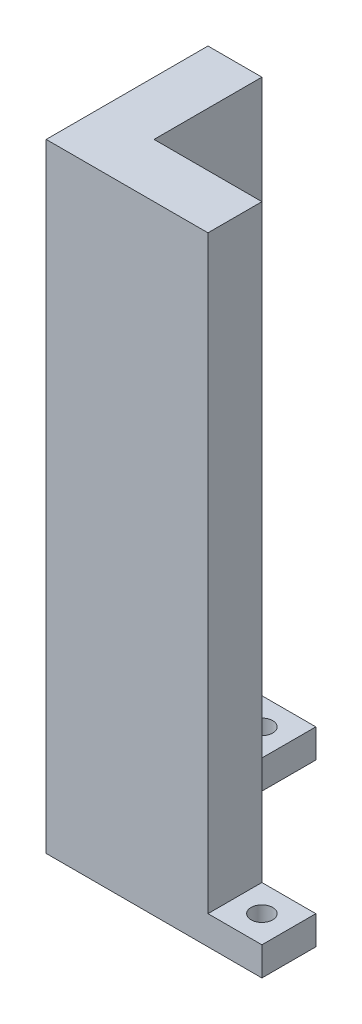
ISO-10303-21;
HEADER;
FILE_DESCRIPTION(('STEP AP214'),'2;1');
FILE_NAME('part.step','',(''),(''),'','','');
FILE_SCHEMA(('AUTOMOTIVE_DESIGN { 1 0 10303 214 1 1 1 1 }'));
ENDSEC;
DATA;
#1=APPLICATION_CONTEXT('core data for automotive mechanical design processes');
#2=APPLICATION_PROTOCOL_DEFINITION('international standard','automotive_design',2000,#1);
#3=PRODUCT_CONTEXT('',#1,'mechanical');
#4=PRODUCT('Part','Part','',(#3));
#5=PRODUCT_RELATED_PRODUCT_CATEGORY('part','',(#4));
#6=PRODUCT_DEFINITION_FORMATION('','',#4);
#7=PRODUCT_DEFINITION_CONTEXT('part definition',#1,'design');
#8=PRODUCT_DEFINITION('design','',#6,#7);
#9=PRODUCT_DEFINITION_SHAPE('','',#8);
#10=(LENGTH_UNIT() NAMED_UNIT(*) SI_UNIT(.MILLI.,.METRE.));
#11=(NAMED_UNIT(*) PLANE_ANGLE_UNIT() SI_UNIT($,.RADIAN.));
#12=(NAMED_UNIT(*) SI_UNIT($,.STERADIAN.) SOLID_ANGLE_UNIT());
#13=UNCERTAINTY_MEASURE_WITH_UNIT(LENGTH_MEASURE(1.E-05),#10,'distance_accuracy_value','');
#14=(GEOMETRIC_REPRESENTATION_CONTEXT(3) GLOBAL_UNCERTAINTY_ASSIGNED_CONTEXT((#13)) GLOBAL_UNIT_ASSIGNED_CONTEXT((#10,
#11,#12)) REPRESENTATION_CONTEXT('',''));
#15=CARTESIAN_POINT('',(0.,0.,0.));
#16=DIRECTION('',(0.,0.,1.));
#17=DIRECTION('',(1.,0.,0.));
#18=AXIS2_PLACEMENT_3D('',#15,#16,#17);
#19=CARTESIAN_POINT('',(0.,4.,0.));
#20=DIRECTION('',(0.,1.,0.));
#21=DIRECTION('',(0.,0.,1.));
#22=AXIS2_PLACEMENT_3D('',#19,#20,#21);
#23=PLANE('',#22);
#24=DIRECTION('',(0.,0.,-1.));
#25=VECTOR('',#24,1.);
#26=CARTESIAN_POINT('',(15.,4.,0.));
#27=LINE('',#26,#25);
#28=CARTESIAN_POINT('',(15.,4.,7.5));
#29=VERTEX_POINT('',#28);
#30=CARTESIAN_POINT('',(15.,4.,0.));
#31=VERTEX_POINT('',#30);
#32=EDGE_CURVE('E54',#29,#31,#27,.T.);
#33=ORIENTED_EDGE('',*,*,#32,.F.);
#34=DIRECTION('',(1.,0.,0.));
#35=VECTOR('',#34,1.);
#36=CARTESIAN_POINT('',(15.,4.,7.5));
#37=LINE('',#36,#35);
#38=CARTESIAN_POINT('',(22.5,4.,7.5));
#39=VERTEX_POINT('',#38);
#40=EDGE_CURVE('E178',#29,#39,#37,.T.);
#41=ORIENTED_EDGE('',*,*,#40,.T.);
#42=DIRECTION('',(0.,0.,-1.));
#43=VECTOR('',#42,1.);
#44=CARTESIAN_POINT('',(22.5,4.,0.));
#45=LINE('',#44,#43);
#46=CARTESIAN_POINT('',(22.5,4.,0.));
#47=VERTEX_POINT('',#46);
#48=EDGE_CURVE('E182',#39,#47,#45,.T.);
#49=ORIENTED_EDGE('',*,*,#48,.T.);
#50=DIRECTION('',(-1.,0.,0.));
#51=VECTOR('',#50,1.);
#52=CARTESIAN_POINT('',(22.5,4.,0.));
#53=LINE('',#52,#51);
#54=EDGE_CURVE('E50',#47,#31,#53,.T.);
#55=ORIENTED_EDGE('',*,*,#54,.T.);
#56=EDGE_LOOP('',(#33,#41,#49,#55));
#57=FACE_BOUND('',#56,.T.);
#58=CARTESIAN_POINT('',(18.75,4.,3.75));
#59=DIRECTION('',(0.,1.,0.));
#60=DIRECTION('',(0.,0.,1.));
#61=AXIS2_PLACEMENT_3D('',#58,#59,#60);
#62=CIRCLE('',#61,1.5);
#63=CARTESIAN_POINT('',(18.75,4.,5.25));
#64=VERTEX_POINT('',#63);
#65=EDGE_CURVE('E249',#64,#64,#62,.T.);
#66=ORIENTED_EDGE('',*,*,#65,.F.);
#67=EDGE_LOOP('',(#66));
#68=FACE_BOUND('',#67,.T.);
#69=ADVANCED_FACE('F33',(#57,#68),#23,.T.);
#70=DIRECTION('',(-1.,0.,0.));
#71=VECTOR('',#70,1.);
#72=CARTESIAN_POINT('',(0.,4.,-15.));
#73=LINE('',#72,#71);
#74=CARTESIAN_POINT('',(0.,4.,-15.));
#75=VERTEX_POINT('',#74);
#76=CARTESIAN_POINT('',(-7.5,4.,-15.));
#77=VERTEX_POINT('',#76);
#78=EDGE_CURVE('E136',#75,#77,#73,.T.);
#79=ORIENTED_EDGE('',*,*,#78,.F.);
#80=DIRECTION('',(0.,0.,-1.));
#81=VECTOR('',#80,1.);
#82=CARTESIAN_POINT('',(0.,4.,-15.));
#83=LINE('',#82,#81);
#84=CARTESIAN_POINT('',(0.,4.,-22.5));
#85=VERTEX_POINT('',#84);
#86=EDGE_CURVE('E208',#75,#85,#83,.T.);
#87=ORIENTED_EDGE('',*,*,#86,.T.);
#88=DIRECTION('',(-1.,0.,0.));
#89=VECTOR('',#88,1.);
#90=CARTESIAN_POINT('',(0.,4.,-22.5));
#91=LINE('',#90,#89);
#92=CARTESIAN_POINT('',(-7.5,4.,-22.5));
#93=VERTEX_POINT('',#92);
#94=EDGE_CURVE('E185',#85,#93,#91,.T.);
#95=ORIENTED_EDGE('',*,*,#94,.T.);
#96=DIRECTION('',(0.,0.,1.));
#97=VECTOR('',#96,1.);
#98=CARTESIAN_POINT('',(-7.5,4.,-22.5));
#99=LINE('',#98,#97);
#100=EDGE_CURVE('E183',#93,#77,#99,.T.);
#101=ORIENTED_EDGE('',*,*,#100,.T.);
#102=EDGE_LOOP('',(#79,#87,#95,#101));
#103=FACE_BOUND('',#102,.T.);
#104=CARTESIAN_POINT('',(-3.75,4.,-18.75));
#105=DIRECTION('',(0.,1.,0.));
#106=DIRECTION('',(0.,0.,1.));
#107=AXIS2_PLACEMENT_3D('',#104,#105,#106);
#108=CIRCLE('',#107,1.5);
#109=CARTESIAN_POINT('',(-3.75,4.,-17.25));
#110=VERTEX_POINT('',#109);
#111=EDGE_CURVE('E198',#110,#110,#108,.T.);
#112=ORIENTED_EDGE('',*,*,#111,.F.);
#113=EDGE_LOOP('',(#112));
#114=FACE_BOUND('',#113,.T.);
#115=ADVANCED_FACE('F223',(#103,#114),#23,.T.);
#116=CARTESIAN_POINT('',(0.,0.,0.));
#117=DIRECTION('',(0.,1.,0.));
#118=DIRECTION('',(0.,0.,1.));
#119=AXIS2_PLACEMENT_3D('',#116,#117,#118);
#120=PLANE('',#119);
#121=DIRECTION('',(0.,0.,-1.));
#122=VECTOR('',#121,1.);
#123=CARTESIAN_POINT('',(0.,0.,-15.));
#124=LINE('',#123,#122);
#125=CARTESIAN_POINT('',(0.,0.,0.));
#126=VERTEX_POINT('',#125);
#127=CARTESIAN_POINT('',(0.,0.,-22.5));
#128=VERTEX_POINT('',#127);
#129=EDGE_CURVE('E195',#126,#128,#124,.T.);
#130=ORIENTED_EDGE('',*,*,#129,.F.);
#131=DIRECTION('',(-1.,0.,0.));
#132=VECTOR('',#131,1.);
#133=CARTESIAN_POINT('',(0.,0.,0.));
#134=LINE('',#133,#132);
#135=CARTESIAN_POINT('',(22.5,0.,0.));
#136=VERTEX_POINT('',#135);
#137=EDGE_CURVE('E118',#136,#126,#134,.T.);
#138=ORIENTED_EDGE('',*,*,#137,.F.);
#139=DIRECTION('',(0.,0.,-1.));
#140=VECTOR('',#139,1.);
#141=CARTESIAN_POINT('',(22.5,0.,0.));
#142=LINE('',#141,#140);
#143=CARTESIAN_POINT('',(22.5,0.,7.5));
#144=VERTEX_POINT('',#143);
#145=EDGE_CURVE('E205',#144,#136,#142,.T.);
#146=ORIENTED_EDGE('',*,*,#145,.F.);
#147=DIRECTION('',(1.,0.,0.));
#148=VECTOR('',#147,1.);
#149=CARTESIAN_POINT('',(15.,0.,7.5));
#150=LINE('',#149,#148);
#151=CARTESIAN_POINT('',(-7.5,0.,7.5));
#152=VERTEX_POINT('',#151);
#153=EDGE_CURVE('E203',#152,#144,#150,.T.);
#154=ORIENTED_EDGE('',*,*,#153,.F.);
#155=DIRECTION('',(0.,0.,1.));
#156=VECTOR('',#155,1.);
#157=CARTESIAN_POINT('',(-7.5,0.,-22.5));
#158=LINE('',#157,#156);
#159=CARTESIAN_POINT('',(-7.5,0.,-22.5));
#160=VERTEX_POINT('',#159);
#161=EDGE_CURVE('E200',#160,#152,#158,.T.);
#162=ORIENTED_EDGE('',*,*,#161,.F.);
#163=DIRECTION('',(-1.,0.,0.));
#164=VECTOR('',#163,1.);
#165=CARTESIAN_POINT('',(0.,0.,-22.5));
#166=LINE('',#165,#164);
#167=EDGE_CURVE('E197',#128,#160,#166,.T.);
#168=ORIENTED_EDGE('',*,*,#167,.F.);
#169=EDGE_LOOP('',(#130,#138,#146,#154,#162,#168));
#170=FACE_BOUND('',#169,.T.);
#171=CARTESIAN_POINT('',(-3.75,0.,-18.75));
#172=DIRECTION('',(0.,1.,0.));
#173=DIRECTION('',(0.,0.,1.));
#174=AXIS2_PLACEMENT_3D('',#171,#172,#173);
#175=CIRCLE('',#174,1.5);
#176=CARTESIAN_POINT('',(-3.75,0.,-17.25));
#177=VERTEX_POINT('',#176);
#178=EDGE_CURVE('E218',#177,#177,#175,.T.);
#179=ORIENTED_EDGE('',*,*,#178,.T.);
#180=EDGE_LOOP('',(#179));
#181=FACE_BOUND('',#180,.T.);
#182=CARTESIAN_POINT('',(18.75,0.,3.75));
#183=DIRECTION('',(0.,1.,0.));
#184=DIRECTION('',(0.,0.,1.));
#185=AXIS2_PLACEMENT_3D('',#182,#183,#184);
#186=CIRCLE('',#185,1.5);
#187=CARTESIAN_POINT('',(18.75,0.,5.25));
#188=VERTEX_POINT('',#187);
#189=EDGE_CURVE('E164',#188,#188,#186,.T.);
#190=ORIENTED_EDGE('',*,*,#189,.T.);
#191=EDGE_LOOP('',(#190));
#192=FACE_BOUND('',#191,.T.);
#193=ADVANCED_FACE('F238',(#170,#181,#192),#120,.F.);
#194=CARTESIAN_POINT('',(0.,4.,-15.));
#195=DIRECTION('',(-1.,0.,0.));
#196=DIRECTION('',(0.,0.,1.));
#197=AXIS2_PLACEMENT_3D('',#194,#195,#196);
#198=PLANE('',#197);
#199=ORIENTED_EDGE('',*,*,#129,.T.);
#200=DIRECTION('',(0.,-1.,0.));
#201=VECTOR('',#200,1.);
#202=CARTESIAN_POINT('',(0.,4.,-22.5));
#203=LINE('',#202,#201);
#204=EDGE_CURVE('E11',#85,#128,#203,.T.);
#205=ORIENTED_EDGE('',*,*,#204,.F.);
#206=ORIENTED_EDGE('',*,*,#86,.F.);
#207=DIRECTION('',(0.,-1.,0.));
#208=VECTOR('',#207,1.);
#209=CARTESIAN_POINT('',(0.,86.,-15.));
#210=LINE('',#209,#208);
#211=CARTESIAN_POINT('',(0.,86.,-15.));
#212=VERTEX_POINT('',#211);
#213=EDGE_CURVE('E126',#212,#75,#210,.T.);
#214=ORIENTED_EDGE('',*,*,#213,.F.);
#215=DIRECTION('',(0.,0.,-1.));
#216=VECTOR('',#215,1.);
#217=CARTESIAN_POINT('',(0.,86.,0.));
#218=LINE('',#217,#216);
#219=CARTESIAN_POINT('',(0.,86.,0.));
#220=VERTEX_POINT('',#219);
#221=EDGE_CURVE('E123',#220,#212,#218,.T.);
#222=ORIENTED_EDGE('',*,*,#221,.F.);
#223=DIRECTION('',(0.,-1.,0.));
#224=VECTOR('',#223,1.);
#225=CARTESIAN_POINT('',(0.,4.,0.));
#226=LINE('',#225,#224);
#227=EDGE_CURVE('E111',#220,#126,#226,.T.);
#228=ORIENTED_EDGE('',*,*,#227,.T.);
#229=EDGE_LOOP('',(#199,#205,#206,#214,#222,#228));
#230=FACE_BOUND('',#229,.T.);
#231=ADVANCED_FACE('F35',(#230),#198,.F.);
#232=CARTESIAN_POINT('',(0.,4.,-22.5));
#233=DIRECTION('',(0.,0.,1.));
#234=DIRECTION('',(1.,0.,0.));
#235=AXIS2_PLACEMENT_3D('',#232,#233,#234);
#236=PLANE('',#235);
#237=ORIENTED_EDGE('',*,*,#167,.T.);
#238=DIRECTION('',(0.,-1.,0.));
#239=VECTOR('',#238,1.);
#240=CARTESIAN_POINT('',(-7.5,4.,-22.5));
#241=LINE('',#240,#239);
#242=EDGE_CURVE('E42',#93,#160,#241,.T.);
#243=ORIENTED_EDGE('',*,*,#242,.F.);
#244=ORIENTED_EDGE('',*,*,#94,.F.);
#245=ORIENTED_EDGE('',*,*,#204,.T.);
#246=EDGE_LOOP('',(#237,#243,#244,#245));
#247=FACE_BOUND('',#246,.T.);
#248=ADVANCED_FACE('F228',(#247),#236,.F.);
#249=CARTESIAN_POINT('',(-7.5,4.,-22.5));
#250=DIRECTION('',(1.,0.,0.));
#251=DIRECTION('',(0.,0.,-1.));
#252=AXIS2_PLACEMENT_3D('',#249,#250,#251);
#253=PLANE('',#252);
#254=ORIENTED_EDGE('',*,*,#161,.T.);
#255=DIRECTION('',(0.,-1.,0.));
#256=VECTOR('',#255,1.);
#257=CARTESIAN_POINT('',(-7.5,4.,7.5));
#258=LINE('',#257,#256);
#259=CARTESIAN_POINT('',(-7.5,86.,7.5));
#260=VERTEX_POINT('',#259);
#261=EDGE_CURVE('E212',#260,#152,#258,.T.);
#262=ORIENTED_EDGE('',*,*,#261,.F.);
#263=DIRECTION('',(0.,0.,1.));
#264=VECTOR('',#263,1.);
#265=CARTESIAN_POINT('',(-7.5,86.,-15.));
#266=LINE('',#265,#264);
#267=CARTESIAN_POINT('',(-7.5,86.,-15.));
#268=VERTEX_POINT('',#267);
#269=EDGE_CURVE('E140',#268,#260,#266,.T.);
#270=ORIENTED_EDGE('',*,*,#269,.F.);
#271=DIRECTION('',(0.,-1.,0.));
#272=VECTOR('',#271,1.);
#273=CARTESIAN_POINT('',(-7.5,86.,-15.));
#274=LINE('',#273,#272);
#275=EDGE_CURVE('E157',#268,#77,#274,.T.);
#276=ORIENTED_EDGE('',*,*,#275,.T.);
#277=ORIENTED_EDGE('',*,*,#100,.F.);
#278=ORIENTED_EDGE('',*,*,#242,.T.);
#279=EDGE_LOOP('',(#254,#262,#270,#276,#277,#278));
#280=FACE_BOUND('',#279,.T.);
#281=ADVANCED_FACE('F232',(#280),#253,.F.);
#282=CARTESIAN_POINT('',(15.,4.,7.5));
#283=DIRECTION('',(0.,0.,-1.));
#284=DIRECTION('',(-1.,0.,0.));
#285=AXIS2_PLACEMENT_3D('',#282,#283,#284);
#286=PLANE('',#285);
#287=ORIENTED_EDGE('',*,*,#153,.T.);
#288=DIRECTION('',(0.,-1.,0.));
#289=VECTOR('',#288,1.);
#290=CARTESIAN_POINT('',(22.5,4.,7.5));
#291=LINE('',#290,#289);
#292=EDGE_CURVE('E180',#39,#144,#291,.T.);
#293=ORIENTED_EDGE('',*,*,#292,.F.);
#294=ORIENTED_EDGE('',*,*,#40,.F.);
#295=DIRECTION('',(0.,-1.,0.));
#296=VECTOR('',#295,1.);
#297=CARTESIAN_POINT('',(15.,86.,7.5));
#298=LINE('',#297,#296);
#299=CARTESIAN_POINT('',(15.,86.,7.5));
#300=VERTEX_POINT('',#299);
#301=EDGE_CURVE('E160',#300,#29,#298,.T.);
#302=ORIENTED_EDGE('',*,*,#301,.F.);
#303=DIRECTION('',(1.,0.,0.));
#304=VECTOR('',#303,1.);
#305=CARTESIAN_POINT('',(-7.5,86.,7.5));
#306=LINE('',#305,#304);
#307=EDGE_CURVE('E143',#260,#300,#306,.T.);
#308=ORIENTED_EDGE('',*,*,#307,.F.);
#309=ORIENTED_EDGE('',*,*,#261,.T.);
#310=EDGE_LOOP('',(#287,#293,#294,#302,#308,#309));
#311=FACE_BOUND('',#310,.T.);
#312=ADVANCED_FACE('F175',(#311),#286,.F.);
#313=CARTESIAN_POINT('',(22.5,4.,0.));
#314=DIRECTION('',(-1.,0.,0.));
#315=DIRECTION('',(0.,0.,1.));
#316=AXIS2_PLACEMENT_3D('',#313,#314,#315);
#317=PLANE('',#316);
#318=ORIENTED_EDGE('',*,*,#145,.T.);
#319=DIRECTION('',(0.,-1.,0.));
#320=VECTOR('',#319,1.);
#321=CARTESIAN_POINT('',(22.5,4.,0.));
#322=LINE('',#321,#320);
#323=EDGE_CURVE('E120',#47,#136,#322,.T.);
#324=ORIENTED_EDGE('',*,*,#323,.F.);
#325=ORIENTED_EDGE('',*,*,#48,.F.);
#326=ORIENTED_EDGE('',*,*,#292,.T.);
#327=EDGE_LOOP('',(#318,#324,#325,#326));
#328=FACE_BOUND('',#327,.T.);
#329=ADVANCED_FACE('F242',(#328),#317,.F.);
#330=CARTESIAN_POINT('',(0.,4.,0.));
#331=DIRECTION('',(0.,0.,1.));
#332=DIRECTION('',(1.,0.,0.));
#333=AXIS2_PLACEMENT_3D('',#330,#331,#332);
#334=PLANE('',#333);
#335=ORIENTED_EDGE('',*,*,#137,.T.);
#336=ORIENTED_EDGE('',*,*,#227,.F.);
#337=DIRECTION('',(-1.,0.,0.));
#338=VECTOR('',#337,1.);
#339=CARTESIAN_POINT('',(15.,86.,0.));
#340=LINE('',#339,#338);
#341=CARTESIAN_POINT('',(15.,86.,0.));
#342=VERTEX_POINT('',#341);
#343=EDGE_CURVE('E116',#342,#220,#340,.T.);
#344=ORIENTED_EDGE('',*,*,#343,.F.);
#345=DIRECTION('',(0.,-1.,0.));
#346=VECTOR('',#345,1.);
#347=CARTESIAN_POINT('',(15.,86.,0.));
#348=LINE('',#347,#346);
#349=EDGE_CURVE('E146',#342,#31,#348,.T.);
#350=ORIENTED_EDGE('',*,*,#349,.T.);
#351=ORIENTED_EDGE('',*,*,#54,.F.);
#352=ORIENTED_EDGE('',*,*,#323,.T.);
#353=EDGE_LOOP('',(#335,#336,#344,#350,#351,#352));
#354=FACE_BOUND('',#353,.T.);
#355=ADVANCED_FACE('F113',(#354),#334,.F.);
#356=CARTESIAN_POINT('',(-3.75,4.,-18.75));
#357=DIRECTION('',(0.,-1.,0.));
#358=DIRECTION('',(0.,0.,-1.));
#359=AXIS2_PLACEMENT_3D('',#356,#357,#358);
#360=CYLINDRICAL_SURFACE('',#359,1.5);
#361=ORIENTED_EDGE('',*,*,#111,.T.);
#362=EDGE_LOOP('',(#361));
#363=FACE_BOUND('',#362,.T.);
#364=ORIENTED_EDGE('',*,*,#178,.F.);
#365=EDGE_LOOP('',(#364));
#366=FACE_BOUND('',#365,.T.);
#367=ADVANCED_FACE('F257',(#363,#366),#360,.F.);
#368=CARTESIAN_POINT('',(18.75,4.,3.75));
#369=DIRECTION('',(0.,-1.,0.));
#370=DIRECTION('',(0.,0.,-1.));
#371=AXIS2_PLACEMENT_3D('',#368,#369,#370);
#372=CYLINDRICAL_SURFACE('',#371,1.5);
#373=ORIENTED_EDGE('',*,*,#65,.T.);
#374=EDGE_LOOP('',(#373));
#375=FACE_BOUND('',#374,.T.);
#376=ORIENTED_EDGE('',*,*,#189,.F.);
#377=EDGE_LOOP('',(#376));
#378=FACE_BOUND('',#377,.T.);
#379=ADVANCED_FACE('F310',(#375,#378),#372,.F.);
#380=CARTESIAN_POINT('',(0.,86.,-15.));
#381=DIRECTION('',(0.,0.,1.));
#382=DIRECTION('',(1.,0.,0.));
#383=AXIS2_PLACEMENT_3D('',#380,#381,#382);
#384=PLANE('',#383);
#385=ORIENTED_EDGE('',*,*,#78,.T.);
#386=ORIENTED_EDGE('',*,*,#275,.F.);
#387=DIRECTION('',(-1.,0.,0.));
#388=VECTOR('',#387,1.);
#389=CARTESIAN_POINT('',(0.,86.,-15.));
#390=LINE('',#389,#388);
#391=EDGE_CURVE('E129',#212,#268,#390,.T.);
#392=ORIENTED_EDGE('',*,*,#391,.F.);
#393=ORIENTED_EDGE('',*,*,#213,.T.);
#394=EDGE_LOOP('',(#385,#386,#392,#393));
#395=FACE_BOUND('',#394,.T.);
#396=ADVANCED_FACE('F236',(#395),#384,.F.);
#397=CARTESIAN_POINT('',(15.,86.,0.));
#398=DIRECTION('',(-1.,0.,0.));
#399=DIRECTION('',(0.,0.,1.));
#400=AXIS2_PLACEMENT_3D('',#397,#398,#399);
#401=PLANE('',#400);
#402=ORIENTED_EDGE('',*,*,#32,.T.);
#403=ORIENTED_EDGE('',*,*,#349,.F.);
#404=DIRECTION('',(0.,0.,-1.));
#405=VECTOR('',#404,1.);
#406=CARTESIAN_POINT('',(15.,86.,0.));
#407=LINE('',#406,#405);
#408=EDGE_CURVE('E133',#300,#342,#407,.T.);
#409=ORIENTED_EDGE('',*,*,#408,.F.);
#410=ORIENTED_EDGE('',*,*,#301,.T.);
#411=EDGE_LOOP('',(#402,#403,#409,#410));
#412=FACE_BOUND('',#411,.T.);
#413=ADVANCED_FACE('F172',(#412),#401,.F.);
#414=CARTESIAN_POINT('',(0.,86.,0.));
#415=DIRECTION('',(0.,-1.,0.));
#416=DIRECTION('',(0.,0.,-1.));
#417=AXIS2_PLACEMENT_3D('',#414,#415,#416);
#418=PLANE('',#417);
#419=ORIENTED_EDGE('',*,*,#343,.T.);
#420=ORIENTED_EDGE('',*,*,#221,.T.);
#421=ORIENTED_EDGE('',*,*,#391,.T.);
#422=ORIENTED_EDGE('',*,*,#269,.T.);
#423=ORIENTED_EDGE('',*,*,#307,.T.);
#424=ORIENTED_EDGE('',*,*,#408,.T.);
#425=EDGE_LOOP('',(#419,#420,#421,#422,#423,#424));
#426=FACE_BOUND('',#425,.T.);
#427=ADVANCED_FACE('F131',(#426),#418,.F.);
#428=CLOSED_SHELL('',(#69,#115,#193,#231,#248,#281,#312,#329,#355,#367,#379,#396,#413,#427));
#429=MANIFOLD_SOLID_BREP('B2',#428);
#430=ADVANCED_BREP_SHAPE_REPRESENTATION('',(#18,#429),#14);
#431=SHAPE_DEFINITION_REPRESENTATION(#9,#430);
ENDSEC;
END-ISO-10303-21;
